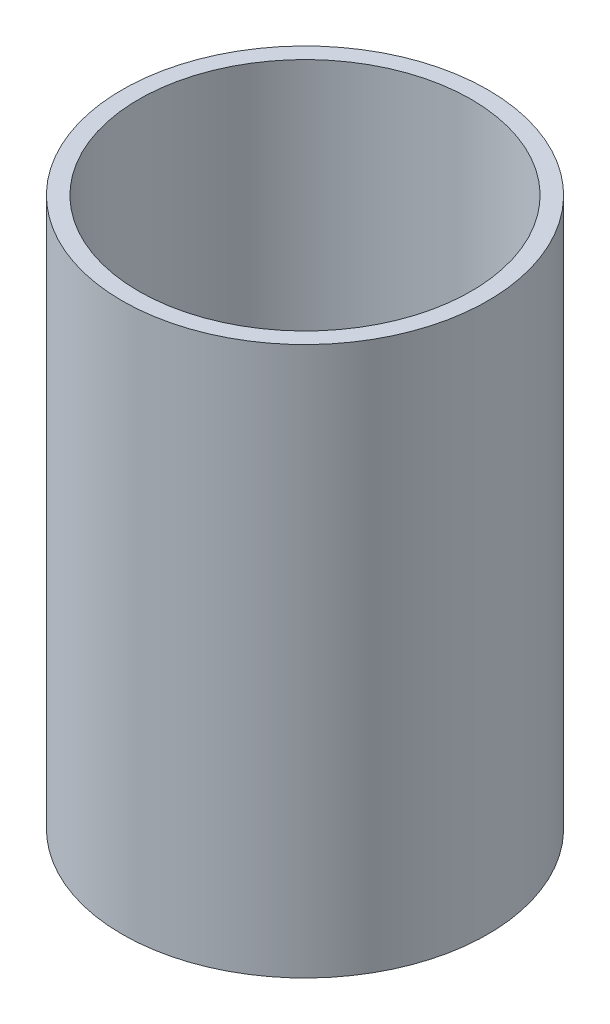
ISO-10303-21;
HEADER;
FILE_DESCRIPTION(('STEP AP214'),'2;1');
FILE_NAME('part.step','',(''),(''),'','','');
FILE_SCHEMA(('AUTOMOTIVE_DESIGN { 1 0 10303 214 1 1 1 1 }'));
ENDSEC;
DATA;
#1=APPLICATION_CONTEXT('core data for automotive mechanical design processes');
#2=APPLICATION_PROTOCOL_DEFINITION('international standard','automotive_design',2000,#1);
#3=PRODUCT_CONTEXT('',#1,'mechanical');
#4=PRODUCT('Part','Part','',(#3));
#5=PRODUCT_RELATED_PRODUCT_CATEGORY('part','',(#4));
#6=PRODUCT_DEFINITION_FORMATION('','',#4);
#7=PRODUCT_DEFINITION_CONTEXT('part definition',#1,'design');
#8=PRODUCT_DEFINITION('design','',#6,#7);
#9=PRODUCT_DEFINITION_SHAPE('','',#8);
#10=(LENGTH_UNIT() NAMED_UNIT(*) SI_UNIT(.MILLI.,.METRE.));
#11=(NAMED_UNIT(*) PLANE_ANGLE_UNIT() SI_UNIT($,.RADIAN.));
#12=(NAMED_UNIT(*) SI_UNIT($,.STERADIAN.) SOLID_ANGLE_UNIT());
#13=UNCERTAINTY_MEASURE_WITH_UNIT(LENGTH_MEASURE(1.E-05),#10,'distance_accuracy_value','');
#14=(GEOMETRIC_REPRESENTATION_CONTEXT(3) GLOBAL_UNCERTAINTY_ASSIGNED_CONTEXT((#13)) GLOBAL_UNIT_ASSIGNED_CONTEXT((#10,
#11,#12)) REPRESENTATION_CONTEXT('',''));
#15=CARTESIAN_POINT('',(0.,0.,0.));
#16=DIRECTION('',(0.,0.,1.));
#17=DIRECTION('',(1.,0.,0.));
#18=AXIS2_PLACEMENT_3D('',#15,#16,#17);
#19=CARTESIAN_POINT('',(0.,33.,0.));
#20=DIRECTION('',(0.,1.,0.));
#21=DIRECTION('',(0.,0.,1.));
#22=AXIS2_PLACEMENT_3D('',#19,#20,#21);
#23=PLANE('',#22);
#24=CARTESIAN_POINT('',(0.,33.,0.));
#25=DIRECTION('',(0.,1.,0.));
#26=DIRECTION('',(0.,0.,1.));
#27=AXIS2_PLACEMENT_3D('',#24,#25,#26);
#28=CIRCLE('',#27,11.);
#29=CARTESIAN_POINT('',(0.,33.,11.));
#30=VERTEX_POINT('',#29);
#31=EDGE_CURVE('E10',#30,#30,#28,.T.);
#32=ORIENTED_EDGE('',*,*,#31,.T.);
#33=EDGE_LOOP('',(#32));
#34=FACE_BOUND('',#33,.T.);
#35=CARTESIAN_POINT('',(0.,33.,0.));
#36=DIRECTION('',(0.,1.,0.));
#37=DIRECTION('',(0.,0.,1.));
#38=AXIS2_PLACEMENT_3D('',#35,#36,#37);
#39=CIRCLE('',#38,10.);
#40=CARTESIAN_POINT('',(0.,33.,10.));
#41=VERTEX_POINT('',#40);
#42=EDGE_CURVE('E44',#41,#41,#39,.T.);
#43=ORIENTED_EDGE('',*,*,#42,.F.);
#44=EDGE_LOOP('',(#43));
#45=FACE_BOUND('',#44,.T.);
#46=ADVANCED_FACE('F33',(#34,#45),#23,.T.);
#47=CARTESIAN_POINT('',(0.,0.,0.));
#48=DIRECTION('',(0.,1.,0.));
#49=DIRECTION('',(0.,0.,1.));
#50=AXIS2_PLACEMENT_3D('',#47,#48,#49);
#51=PLANE('',#50);
#52=CARTESIAN_POINT('',(0.,0.,0.));
#53=DIRECTION('',(0.,1.,0.));
#54=DIRECTION('',(0.,0.,1.));
#55=AXIS2_PLACEMENT_3D('',#52,#53,#54);
#56=CIRCLE('',#55,11.);
#57=CARTESIAN_POINT('',(0.,0.,11.));
#58=VERTEX_POINT('',#57);
#59=EDGE_CURVE('E37',#58,#58,#56,.T.);
#60=ORIENTED_EDGE('',*,*,#59,.F.);
#61=EDGE_LOOP('',(#60));
#62=FACE_BOUND('',#61,.T.);
#63=CARTESIAN_POINT('',(0.,0.,0.));
#64=DIRECTION('',(0.,1.,0.));
#65=DIRECTION('',(0.,0.,1.));
#66=AXIS2_PLACEMENT_3D('',#63,#64,#65);
#67=CIRCLE('',#66,10.);
#68=CARTESIAN_POINT('',(0.,0.,10.));
#69=VERTEX_POINT('',#68);
#70=EDGE_CURVE('E46',#69,#69,#67,.T.);
#71=ORIENTED_EDGE('',*,*,#70,.T.);
#72=EDGE_LOOP('',(#71));
#73=FACE_BOUND('',#72,.T.);
#74=ADVANCED_FACE('F56',(#62,#73),#51,.F.);
#75=CARTESIAN_POINT('',(0.,33.,0.));
#76=DIRECTION('',(0.,-1.,0.));
#77=DIRECTION('',(0.,0.,-1.));
#78=AXIS2_PLACEMENT_3D('',#75,#76,#77);
#79=CYLINDRICAL_SURFACE('',#78,11.);
#80=ORIENTED_EDGE('',*,*,#31,.F.);
#81=EDGE_LOOP('',(#80));
#82=FACE_BOUND('',#81,.T.);
#83=ORIENTED_EDGE('',*,*,#59,.T.);
#84=EDGE_LOOP('',(#83));
#85=FACE_BOUND('',#84,.T.);
#86=ADVANCED_FACE('F35',(#82,#85),#79,.T.);
#87=CARTESIAN_POINT('',(0.,33.,0.));
#88=DIRECTION('',(0.,-1.,0.));
#89=DIRECTION('',(0.,0.,-1.));
#90=AXIS2_PLACEMENT_3D('',#87,#88,#89);
#91=CYLINDRICAL_SURFACE('',#90,10.);
#92=ORIENTED_EDGE('',*,*,#42,.T.);
#93=EDGE_LOOP('',(#92));
#94=FACE_BOUND('',#93,.T.);
#95=ORIENTED_EDGE('',*,*,#70,.F.);
#96=EDGE_LOOP('',(#95));
#97=FACE_BOUND('',#96,.T.);
#98=ADVANCED_FACE('F52',(#94,#97),#91,.F.);
#99=CLOSED_SHELL('',(#46,#74,#86,#98));
#100=MANIFOLD_SOLID_BREP('B2',#99);
#101=ADVANCED_BREP_SHAPE_REPRESENTATION('',(#18,#100),#14);
#102=SHAPE_DEFINITION_REPRESENTATION(#9,#101);
ENDSEC;
END-ISO-10303-21;
